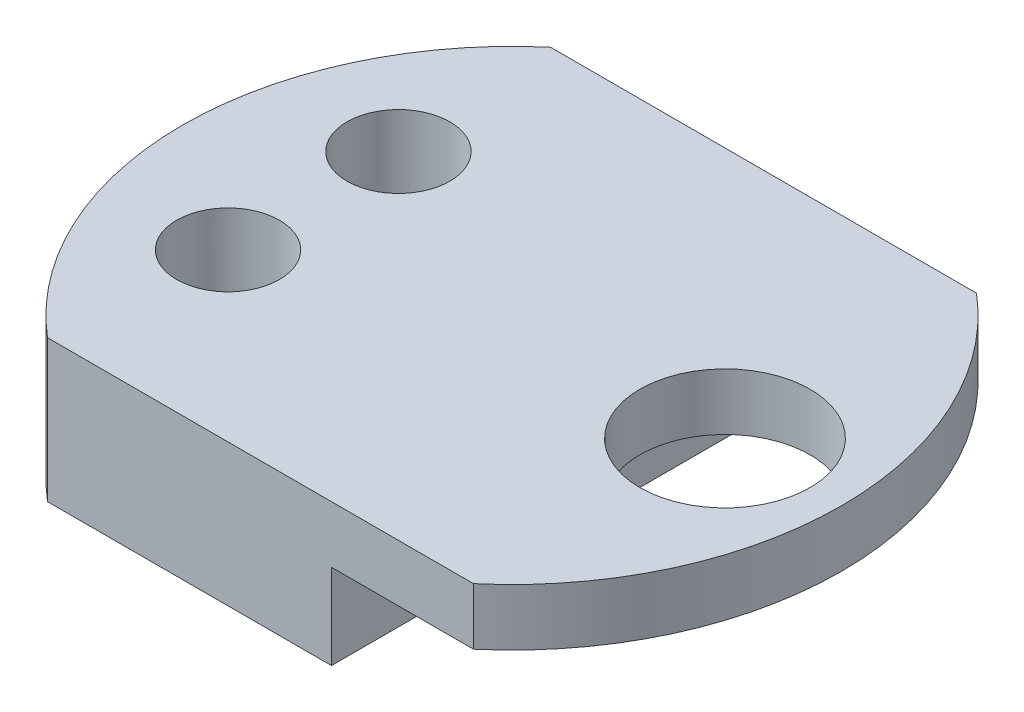
ISO-10303-21;
HEADER;
FILE_DESCRIPTION(('STEP AP214'),'2;1');
FILE_NAME('part.step','',(''),(''),'','','');
FILE_SCHEMA(('AUTOMOTIVE_DESIGN { 1 0 10303 214 1 1 1 1 }'));
ENDSEC;
DATA;
#1=APPLICATION_CONTEXT('core data for automotive mechanical design processes');
#2=APPLICATION_PROTOCOL_DEFINITION('international standard','automotive_design',2000,#1);
#3=PRODUCT_CONTEXT('',#1,'mechanical');
#4=PRODUCT('Part','Part','',(#3));
#5=PRODUCT_RELATED_PRODUCT_CATEGORY('part','',(#4));
#6=PRODUCT_DEFINITION_FORMATION('','',#4);
#7=PRODUCT_DEFINITION_CONTEXT('part definition',#1,'design');
#8=PRODUCT_DEFINITION('design','',#6,#7);
#9=PRODUCT_DEFINITION_SHAPE('','',#8);
#10=(LENGTH_UNIT() NAMED_UNIT(*) SI_UNIT(.MILLI.,.METRE.));
#11=(NAMED_UNIT(*) PLANE_ANGLE_UNIT() SI_UNIT($,.RADIAN.));
#12=(NAMED_UNIT(*) SI_UNIT($,.STERADIAN.) SOLID_ANGLE_UNIT());
#13=UNCERTAINTY_MEASURE_WITH_UNIT(LENGTH_MEASURE(1.E-05),#10,'distance_accuracy_value','');
#14=(GEOMETRIC_REPRESENTATION_CONTEXT(3) GLOBAL_UNCERTAINTY_ASSIGNED_CONTEXT((#13)) GLOBAL_UNIT_ASSIGNED_CONTEXT((#10,
#11,#12)) REPRESENTATION_CONTEXT('',''));
#15=CARTESIAN_POINT('',(0.,0.,0.));
#16=DIRECTION('',(0.,0.,1.));
#17=DIRECTION('',(1.,0.,0.));
#18=AXIS2_PLACEMENT_3D('',#15,#16,#17);
#19=CARTESIAN_POINT('',(0.,6.35,0.));
#20=DIRECTION('',(0.,-1.,0.));
#21=DIRECTION('',(0.,0.,-1.));
#22=AXIS2_PLACEMENT_3D('',#19,#20,#21);
#23=CYLINDRICAL_SURFACE('',#22,14.7406962182931);
#24=DIRECTION('',(0.,-1.,0.));
#25=VECTOR('',#24,1.);
#26=CARTESIAN_POINT('',(9.525,6.35,11.25));
#27=LINE('',#26,#25);
#28=CARTESIAN_POINT('',(9.525,6.35,11.25));
#29=VERTEX_POINT('',#28);
#30=CARTESIAN_POINT('',(9.525,3.81,11.25));
#31=VERTEX_POINT('',#30);
#32=EDGE_CURVE('E119',#29,#31,#27,.T.);
#33=ORIENTED_EDGE('',*,*,#32,.T.);
#34=CARTESIAN_POINT('',(0.,3.81,0.));
#35=DIRECTION('',(0.,-1.,0.));
#36=DIRECTION('',(0.,0.,1.));
#37=AXIS2_PLACEMENT_3D('',#34,#35,#36);
#38=CIRCLE('',#37,14.7406962182931);
#39=CARTESIAN_POINT('',(9.525,3.81,-11.25));
#40=VERTEX_POINT('',#39);
#41=EDGE_CURVE('E103',#40,#31,#38,.T.);
#42=ORIENTED_EDGE('',*,*,#41,.F.);
#43=DIRECTION('',(0.,-1.,0.));
#44=VECTOR('',#43,1.);
#45=CARTESIAN_POINT('',(9.52500000000001,6.35,-11.25));
#46=LINE('',#45,#44);
#47=CARTESIAN_POINT('',(9.52500000000001,6.35,-11.25));
#48=VERTEX_POINT('',#47);
#49=EDGE_CURVE('E11',#48,#40,#46,.T.);
#50=ORIENTED_EDGE('',*,*,#49,.F.);
#51=CARTESIAN_POINT('',(0.,6.35,0.));
#52=DIRECTION('',(0.,1.,0.));
#53=DIRECTION('',(0.,0.,1.));
#54=AXIS2_PLACEMENT_3D('',#51,#52,#53);
#55=CIRCLE('',#54,14.7406962182931);
#56=EDGE_CURVE('E123',#29,#48,#55,.T.);
#57=ORIENTED_EDGE('',*,*,#56,.F.);
#58=EDGE_LOOP('',(#33,#42,#50,#57));
#59=FACE_BOUND('',#58,.T.);
#60=ADVANCED_FACE('F39',(#59),#23,.T.);
#61=CARTESIAN_POINT('',(-9.52500000000001,6.35,-11.25));
#62=DIRECTION('',(0.,0.,1.));
#63=DIRECTION('',(1.,0.,0.));
#64=AXIS2_PLACEMENT_3D('',#61,#62,#63);
#65=PLANE('',#64);
#66=DIRECTION('',(1.,0.,0.));
#67=VECTOR('',#66,1.);
#68=CARTESIAN_POINT('',(9.525,3.81,-11.25));
#69=LINE('',#68,#67);
#70=CARTESIAN_POINT('',(3.175,3.81,-11.25));
#71=VERTEX_POINT('',#70);
#72=EDGE_CURVE('E110',#71,#40,#69,.T.);
#73=ORIENTED_EDGE('',*,*,#72,.F.);
#74=DIRECTION('',(0.,-1.,0.));
#75=VECTOR('',#74,1.);
#76=CARTESIAN_POINT('',(3.175,3.81,-11.25));
#77=LINE('',#76,#75);
#78=CARTESIAN_POINT('',(3.175,0.,-11.25));
#79=VERTEX_POINT('',#78);
#80=EDGE_CURVE('E158',#71,#79,#77,.T.);
#81=ORIENTED_EDGE('',*,*,#80,.T.);
#82=DIRECTION('',(-1.,0.,0.));
#83=VECTOR('',#82,1.);
#84=CARTESIAN_POINT('',(-9.52500000000001,0.,-11.25));
#85=LINE('',#84,#83);
#86=CARTESIAN_POINT('',(-9.52500000000001,0.,-11.25));
#87=VERTEX_POINT('',#86);
#88=EDGE_CURVE('E139',#79,#87,#85,.T.);
#89=ORIENTED_EDGE('',*,*,#88,.T.);
#90=DIRECTION('',(0.,-1.,0.));
#91=VECTOR('',#90,1.);
#92=CARTESIAN_POINT('',(-9.52500000000001,6.35,-11.25));
#93=LINE('',#92,#91);
#94=CARTESIAN_POINT('',(-9.52500000000001,6.35,-11.25));
#95=VERTEX_POINT('',#94);
#96=EDGE_CURVE('E47',#95,#87,#93,.T.);
#97=ORIENTED_EDGE('',*,*,#96,.F.);
#98=DIRECTION('',(-1.,0.,0.));
#99=VECTOR('',#98,1.);
#100=CARTESIAN_POINT('',(-9.52500000000001,6.35,-11.25));
#101=LINE('',#100,#99);
#102=EDGE_CURVE('E87',#48,#95,#101,.T.);
#103=ORIENTED_EDGE('',*,*,#102,.F.);
#104=ORIENTED_EDGE('',*,*,#49,.T.);
#105=EDGE_LOOP('',(#73,#81,#89,#97,#103,#104));
#106=FACE_BOUND('',#105,.T.);
#107=ADVANCED_FACE('F162',(#106),#65,.F.);
#108=CARTESIAN_POINT('',(0.,6.35,0.));
#109=DIRECTION('',(0.,-1.,0.));
#110=DIRECTION('',(0.,0.,-1.));
#111=AXIS2_PLACEMENT_3D('',#108,#109,#110);
#112=CYLINDRICAL_SURFACE('',#111,14.7406962182931);
#113=CARTESIAN_POINT('',(0.,0.,0.));
#114=DIRECTION('',(0.,1.,0.));
#115=DIRECTION('',(0.,0.,1.));
#116=AXIS2_PLACEMENT_3D('',#113,#114,#115);
#117=CIRCLE('',#116,14.7406962182931);
#118=CARTESIAN_POINT('',(-9.52500000000001,0.,11.25));
#119=VERTEX_POINT('',#118);
#120=EDGE_CURVE('E80',#87,#119,#117,.T.);
#121=ORIENTED_EDGE('',*,*,#120,.T.);
#122=DIRECTION('',(0.,-1.,0.));
#123=VECTOR('',#122,1.);
#124=CARTESIAN_POINT('',(-9.52500000000001,6.35,11.25));
#125=LINE('',#124,#123);
#126=CARTESIAN_POINT('',(-9.52500000000001,6.35,11.25));
#127=VERTEX_POINT('',#126);
#128=EDGE_CURVE('E124',#127,#119,#125,.T.);
#129=ORIENTED_EDGE('',*,*,#128,.F.);
#130=CARTESIAN_POINT('',(0.,6.35,0.));
#131=DIRECTION('',(0.,1.,0.));
#132=DIRECTION('',(0.,0.,1.));
#133=AXIS2_PLACEMENT_3D('',#130,#131,#132);
#134=CIRCLE('',#133,14.7406962182931);
#135=EDGE_CURVE('E127',#95,#127,#134,.T.);
#136=ORIENTED_EDGE('',*,*,#135,.F.);
#137=ORIENTED_EDGE('',*,*,#96,.T.);
#138=EDGE_LOOP('',(#121,#129,#136,#137));
#139=FACE_BOUND('',#138,.T.);
#140=ADVANCED_FACE('F167',(#139),#112,.T.);
#141=CARTESIAN_POINT('',(-9.52500000000001,6.35,11.25));
#142=DIRECTION('',(0.,0.,-1.));
#143=DIRECTION('',(-1.,0.,0.));
#144=AXIS2_PLACEMENT_3D('',#141,#142,#143);
#145=PLANE('',#144);
#146=DIRECTION('',(1.,0.,0.));
#147=VECTOR('',#146,1.);
#148=CARTESIAN_POINT('',(-9.52500000000001,0.,11.25));
#149=LINE('',#148,#147);
#150=CARTESIAN_POINT('',(3.17499999999999,0.,11.25));
#151=VERTEX_POINT('',#150);
#152=EDGE_CURVE('E130',#119,#151,#149,.T.);
#153=ORIENTED_EDGE('',*,*,#152,.T.);
#154=DIRECTION('',(0.,-1.,0.));
#155=VECTOR('',#154,1.);
#156=CARTESIAN_POINT('',(3.17499999999999,3.81,11.25));
#157=LINE('',#156,#155);
#158=CARTESIAN_POINT('',(3.17499999999999,3.81,11.25));
#159=VERTEX_POINT('',#158);
#160=EDGE_CURVE('E55',#159,#151,#157,.T.);
#161=ORIENTED_EDGE('',*,*,#160,.F.);
#162=DIRECTION('',(-1.,0.,0.));
#163=VECTOR('',#162,1.);
#164=CARTESIAN_POINT('',(9.525,3.81,11.25));
#165=LINE('',#164,#163);
#166=EDGE_CURVE('E108',#31,#159,#165,.T.);
#167=ORIENTED_EDGE('',*,*,#166,.F.);
#168=ORIENTED_EDGE('',*,*,#32,.F.);
#169=DIRECTION('',(1.,0.,0.));
#170=VECTOR('',#169,1.);
#171=CARTESIAN_POINT('',(-9.52500000000001,6.35,11.25));
#172=LINE('',#171,#170);
#173=EDGE_CURVE('E64',#127,#29,#172,.T.);
#174=ORIENTED_EDGE('',*,*,#173,.F.);
#175=ORIENTED_EDGE('',*,*,#128,.T.);
#176=EDGE_LOOP('',(#153,#161,#167,#168,#174,#175));
#177=FACE_BOUND('',#176,.T.);
#178=ADVANCED_FACE('F118',(#177),#145,.F.);
#179=CARTESIAN_POINT('',(0.,6.35,0.));
#180=DIRECTION('',(0.,1.,0.));
#181=DIRECTION('',(0.,0.,1.));
#182=AXIS2_PLACEMENT_3D('',#179,#180,#181);
#183=PLANE('',#182);
#184=CARTESIAN_POINT('',(9.525,6.35,0.));
#185=DIRECTION('',(0.,1.,0.));
#186=DIRECTION('',(0.,0.,1.));
#187=AXIS2_PLACEMENT_3D('',#184,#185,#186);
#188=CIRCLE('',#187,3.81);
#189=CARTESIAN_POINT('',(9.525,6.35,3.81));
#190=VERTEX_POINT('',#189);
#191=EDGE_CURVE('E152',#190,#190,#188,.T.);
#192=ORIENTED_EDGE('',*,*,#191,.F.);
#193=EDGE_LOOP('',(#192));
#194=FACE_BOUND('',#193,.T.);
#195=CARTESIAN_POINT('',(-8.89,6.35,3.81));
#196=DIRECTION('',(0.,1.,0.));
#197=DIRECTION('',(0.,0.,-1.));
#198=AXIS2_PLACEMENT_3D('',#195,#196,#197);
#199=CIRCLE('',#198,2.3);
#200=CARTESIAN_POINT('',(-8.89,6.35,1.51));
#201=VERTEX_POINT('',#200);
#202=EDGE_CURVE('E151',#201,#201,#199,.T.);
#203=ORIENTED_EDGE('',*,*,#202,.F.);
#204=EDGE_LOOP('',(#203));
#205=FACE_BOUND('',#204,.T.);
#206=CARTESIAN_POINT('',(-8.89,6.35,-3.81));
#207=DIRECTION('',(0.,1.,0.));
#208=DIRECTION('',(0.,0.,1.));
#209=AXIS2_PLACEMENT_3D('',#206,#207,#208);
#210=CIRCLE('',#209,2.3);
#211=CARTESIAN_POINT('',(-8.89,6.35,-1.51));
#212=VERTEX_POINT('',#211);
#213=EDGE_CURVE('E137',#212,#212,#210,.T.);
#214=ORIENTED_EDGE('',*,*,#213,.F.);
#215=EDGE_LOOP('',(#214));
#216=FACE_BOUND('',#215,.T.);
#217=ORIENTED_EDGE('',*,*,#56,.T.);
#218=ORIENTED_EDGE('',*,*,#102,.T.);
#219=ORIENTED_EDGE('',*,*,#135,.T.);
#220=ORIENTED_EDGE('',*,*,#173,.T.);
#221=EDGE_LOOP('',(#217,#218,#219,#220));
#222=FACE_BOUND('',#221,.T.);
#223=ADVANCED_FACE('F168',(#194,#205,#216,#222),#183,.T.);
#224=CARTESIAN_POINT('',(0.,0.,0.));
#225=DIRECTION('',(0.,1.,0.));
#226=DIRECTION('',(0.,0.,1.));
#227=AXIS2_PLACEMENT_3D('',#224,#225,#226);
#228=PLANE('',#227);
#229=CARTESIAN_POINT('',(-8.89,0.,3.81));
#230=DIRECTION('',(0.,1.,0.));
#231=DIRECTION('',(0.,0.,1.));
#232=AXIS2_PLACEMENT_3D('',#229,#230,#231);
#233=CIRCLE('',#232,2.3);
#234=CARTESIAN_POINT('',(-8.89,0.,6.11));
#235=VERTEX_POINT('',#234);
#236=EDGE_CURVE('E136',#235,#235,#233,.T.);
#237=ORIENTED_EDGE('',*,*,#236,.T.);
#238=EDGE_LOOP('',(#237));
#239=FACE_BOUND('',#238,.T.);
#240=CARTESIAN_POINT('',(-8.89,0.,-3.81));
#241=DIRECTION('',(0.,1.,0.));
#242=DIRECTION('',(0.,0.,1.));
#243=AXIS2_PLACEMENT_3D('',#240,#241,#242);
#244=CIRCLE('',#243,2.3);
#245=CARTESIAN_POINT('',(-8.89,0.,-1.51));
#246=VERTEX_POINT('',#245);
#247=EDGE_CURVE('E134',#246,#246,#244,.T.);
#248=ORIENTED_EDGE('',*,*,#247,.T.);
#249=EDGE_LOOP('',(#248));
#250=FACE_BOUND('',#249,.T.);
#251=ORIENTED_EDGE('',*,*,#88,.F.);
#252=DIRECTION('',(0.,0.,-1.));
#253=VECTOR('',#252,1.);
#254=CARTESIAN_POINT('',(3.17499999999999,0.,11.25));
#255=LINE('',#254,#253);
#256=EDGE_CURVE('E114',#151,#79,#255,.T.);
#257=ORIENTED_EDGE('',*,*,#256,.F.);
#258=ORIENTED_EDGE('',*,*,#152,.F.);
#259=ORIENTED_EDGE('',*,*,#120,.F.);
#260=EDGE_LOOP('',(#251,#257,#258,#259));
#261=FACE_BOUND('',#260,.T.);
#262=ADVANCED_FACE('F164',(#239,#250,#261),#228,.F.);
#263=CARTESIAN_POINT('',(-8.89,-6.35,-3.81));
#264=DIRECTION('',(0.,1.,0.));
#265=DIRECTION('',(0.,0.,1.));
#266=AXIS2_PLACEMENT_3D('',#263,#264,#265);
#267=CYLINDRICAL_SURFACE('',#266,2.3);
#268=ORIENTED_EDGE('',*,*,#213,.T.);
#269=EDGE_LOOP('',(#268));
#270=FACE_BOUND('',#269,.T.);
#271=ORIENTED_EDGE('',*,*,#247,.F.);
#272=EDGE_LOOP('',(#271));
#273=FACE_BOUND('',#272,.T.);
#274=ADVANCED_FACE('F177',(#270,#273),#267,.F.);
#275=CARTESIAN_POINT('',(-8.89,-6.35,3.81));
#276=DIRECTION('',(0.,1.,0.));
#277=DIRECTION('',(0.,0.,1.));
#278=AXIS2_PLACEMENT_3D('',#275,#276,#277);
#279=CYLINDRICAL_SURFACE('',#278,2.3);
#280=ORIENTED_EDGE('',*,*,#202,.T.);
#281=EDGE_LOOP('',(#280));
#282=FACE_BOUND('',#281,.T.);
#283=ORIENTED_EDGE('',*,*,#236,.F.);
#284=EDGE_LOOP('',(#283));
#285=FACE_BOUND('',#284,.T.);
#286=ADVANCED_FACE('F223',(#282,#285),#279,.F.);
#287=CARTESIAN_POINT('',(9.525,-6.35,0.));
#288=DIRECTION('',(0.,1.,0.));
#289=DIRECTION('',(0.,0.,1.));
#290=AXIS2_PLACEMENT_3D('',#287,#288,#289);
#291=CYLINDRICAL_SURFACE('',#290,3.81);
#292=CARTESIAN_POINT('',(9.525,3.81,0.));
#293=DIRECTION('',(0.,1.,0.));
#294=DIRECTION('',(0.,0.,1.));
#295=AXIS2_PLACEMENT_3D('',#292,#293,#294);
#296=CIRCLE('',#295,3.81);
#297=CARTESIAN_POINT('',(9.525,3.81,3.81));
#298=VERTEX_POINT('',#297);
#299=EDGE_CURVE('E42',#298,#298,#296,.F.);
#300=ORIENTED_EDGE('',*,*,#299,.T.);
#301=EDGE_LOOP('',(#300));
#302=FACE_BOUND('',#301,.T.);
#303=ORIENTED_EDGE('',*,*,#191,.T.);
#304=EDGE_LOOP('',(#303));
#305=FACE_BOUND('',#304,.T.);
#306=ADVANCED_FACE('F231',(#302,#305),#291,.F.);
#307=CARTESIAN_POINT('',(0.,3.81,0.));
#308=DIRECTION('',(0.,1.,0.));
#309=DIRECTION('',(0.,0.,1.));
#310=AXIS2_PLACEMENT_3D('',#307,#308,#309);
#311=PLANE('',#310);
#312=ORIENTED_EDGE('',*,*,#41,.T.);
#313=ORIENTED_EDGE('',*,*,#166,.T.);
#314=DIRECTION('',(0.,0.,-1.));
#315=VECTOR('',#314,1.);
#316=CARTESIAN_POINT('',(3.17499999999999,3.81,11.25));
#317=LINE('',#316,#315);
#318=EDGE_CURVE('E121',#159,#71,#317,.T.);
#319=ORIENTED_EDGE('',*,*,#318,.T.);
#320=ORIENTED_EDGE('',*,*,#72,.T.);
#321=EDGE_LOOP('',(#312,#313,#319,#320));
#322=FACE_BOUND('',#321,.T.);
#323=ORIENTED_EDGE('',*,*,#299,.F.);
#324=EDGE_LOOP('',(#323));
#325=FACE_BOUND('',#324,.T.);
#326=ADVANCED_FACE('F105',(#322,#325),#311,.F.);
#327=CARTESIAN_POINT('',(3.17499999999999,3.81,11.25));
#328=DIRECTION('',(-1.,0.,0.));
#329=DIRECTION('',(0.,0.,1.));
#330=AXIS2_PLACEMENT_3D('',#327,#328,#329);
#331=PLANE('',#330);
#332=ORIENTED_EDGE('',*,*,#256,.T.);
#333=ORIENTED_EDGE('',*,*,#80,.F.);
#334=ORIENTED_EDGE('',*,*,#318,.F.);
#335=ORIENTED_EDGE('',*,*,#160,.T.);
#336=EDGE_LOOP('',(#332,#333,#334,#335));
#337=FACE_BOUND('',#336,.T.);
#338=ADVANCED_FACE('F249',(#337),#331,.F.);
#339=CLOSED_SHELL('',(#60,#107,#140,#178,#223,#262,#274,#286,#306,#326,#338));
#340=MANIFOLD_SOLID_BREP('B2',#339);
#341=ADVANCED_BREP_SHAPE_REPRESENTATION('',(#18,#340),#14);
#342=SHAPE_DEFINITION_REPRESENTATION(#9,#341);
ENDSEC;
END-ISO-10303-21;
